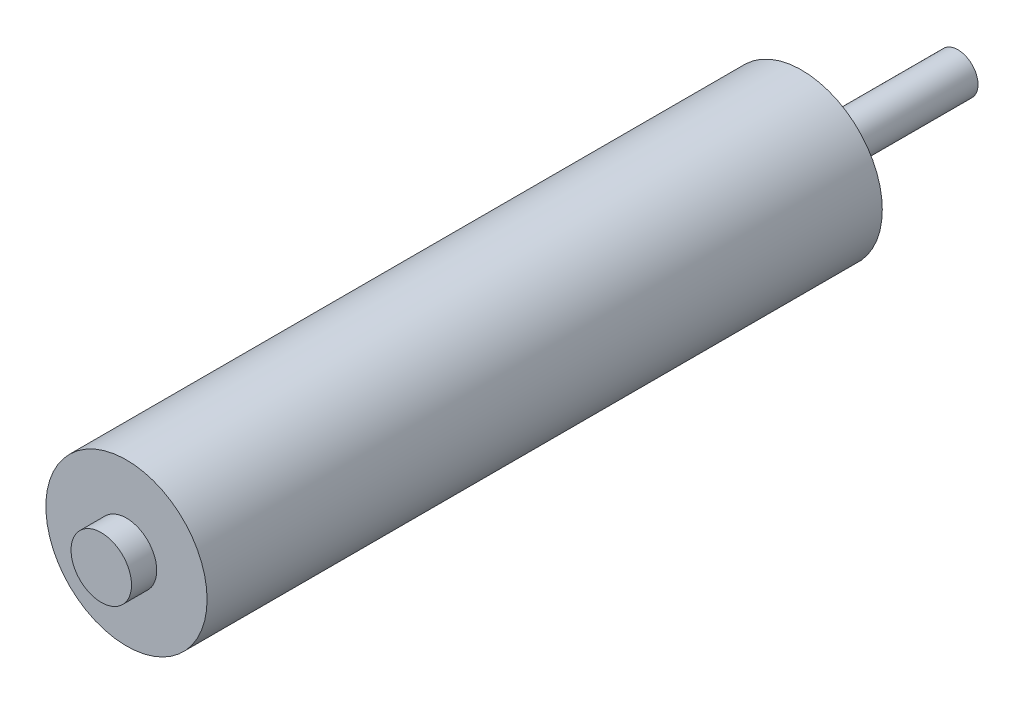
ISO-10303-21;
HEADER;
FILE_DESCRIPTION(('STEP AP214'),'2;1');
FILE_NAME('part.step','',(''),(''),'','','');
FILE_SCHEMA(('AUTOMOTIVE_DESIGN { 1 0 10303 214 1 1 1 1 }'));
ENDSEC;
DATA;
#1=APPLICATION_CONTEXT('core data for automotive mechanical design processes');
#2=APPLICATION_PROTOCOL_DEFINITION('international standard','automotive_design',2000,#1);
#3=PRODUCT_CONTEXT('',#1,'mechanical');
#4=PRODUCT('Part','Part','',(#3));
#5=PRODUCT_RELATED_PRODUCT_CATEGORY('part','',(#4));
#6=PRODUCT_DEFINITION_FORMATION('','',#4);
#7=PRODUCT_DEFINITION_CONTEXT('part definition',#1,'design');
#8=PRODUCT_DEFINITION('design','',#6,#7);
#9=PRODUCT_DEFINITION_SHAPE('','',#8);
#10=(LENGTH_UNIT() NAMED_UNIT(*) SI_UNIT(.MILLI.,.METRE.));
#11=(NAMED_UNIT(*) PLANE_ANGLE_UNIT() SI_UNIT($,.RADIAN.));
#12=(NAMED_UNIT(*) SI_UNIT($,.STERADIAN.) SOLID_ANGLE_UNIT());
#13=UNCERTAINTY_MEASURE_WITH_UNIT(LENGTH_MEASURE(1.E-05),#10,'distance_accuracy_value','');
#14=(GEOMETRIC_REPRESENTATION_CONTEXT(3) GLOBAL_UNCERTAINTY_ASSIGNED_CONTEXT((#13)) GLOBAL_UNIT_ASSIGNED_CONTEXT((#10,
#11,#12)) REPRESENTATION_CONTEXT('',''));
#15=CARTESIAN_POINT('',(0.,0.,0.));
#16=DIRECTION('',(0.,0.,1.));
#17=DIRECTION('',(1.,0.,0.));
#18=AXIS2_PLACEMENT_3D('',#15,#16,#17);
#19=CARTESIAN_POINT('',(0.,0.,-2.5));
#20=DIRECTION('',(0.,0.,-1.));
#21=DIRECTION('',(-1.,0.,0.));
#22=AXIS2_PLACEMENT_3D('',#19,#20,#21);
#23=PLANE('',#22);
#24=CARTESIAN_POINT('',(0.,0.,-2.5));
#25=DIRECTION('',(0.,0.,-1.));
#26=DIRECTION('',(-1.,0.,0.));
#27=AXIS2_PLACEMENT_3D('',#24,#25,#26);
#28=CIRCLE('',#27,3.);
#29=CARTESIAN_POINT('',(-3.,0.,-2.5));
#30=VERTEX_POINT('',#29);
#31=EDGE_CURVE('E68',#30,#30,#28,.T.);
#32=ORIENTED_EDGE('',*,*,#31,.T.);
#33=EDGE_LOOP('',(#32));
#34=FACE_BOUND('',#33,.T.);
#35=CARTESIAN_POINT('',(0.,0.,-2.5));
#36=DIRECTION('',(0.,0.,-1.));
#37=DIRECTION('',(-1.,0.,0.));
#38=AXIS2_PLACEMENT_3D('',#35,#36,#37);
#39=CIRCLE('',#38,2.);
#40=CARTESIAN_POINT('',(-2.,0.,-2.5));
#41=VERTEX_POINT('',#40);
#42=EDGE_CURVE('E74',#41,#41,#39,.T.);
#43=ORIENTED_EDGE('',*,*,#42,.F.);
#44=EDGE_LOOP('',(#43));
#45=FACE_BOUND('',#44,.T.);
#46=ADVANCED_FACE('F47',(#34,#45),#23,.T.);
#47=CARTESIAN_POINT('',(0.,0.,0.));
#48=DIRECTION('',(0.,0.,1.));
#49=DIRECTION('',(1.,0.,0.));
#50=AXIS2_PLACEMENT_3D('',#47,#48,#49);
#51=PLANE('',#50);
#52=CARTESIAN_POINT('',(0.,0.,0.));
#53=DIRECTION('',(0.,0.,1.));
#54=DIRECTION('',(1.,0.,0.));
#55=AXIS2_PLACEMENT_3D('',#52,#53,#54);
#56=CIRCLE('',#55,8.);
#57=CARTESIAN_POINT('',(8.,0.,0.));
#58=VERTEX_POINT('',#57);
#59=EDGE_CURVE('E58',#58,#58,#56,.T.);
#60=ORIENTED_EDGE('',*,*,#59,.F.);
#61=EDGE_LOOP('',(#60));
#62=FACE_BOUND('',#61,.T.);
#63=CARTESIAN_POINT('',(0.,0.,0.));
#64=DIRECTION('',(0.,0.,1.));
#65=DIRECTION('',(1.,0.,0.));
#66=AXIS2_PLACEMENT_3D('',#63,#64,#65);
#67=CIRCLE('',#66,3.);
#68=CARTESIAN_POINT('',(3.,0.,0.));
#69=VERTEX_POINT('',#68);
#70=EDGE_CURVE('E12',#69,#69,#67,.F.);
#71=ORIENTED_EDGE('',*,*,#70,.F.);
#72=EDGE_LOOP('',(#71));
#73=FACE_BOUND('',#72,.T.);
#74=ADVANCED_FACE('F90',(#62,#73),#51,.F.);
#75=CARTESIAN_POINT('',(0.,0.,67.));
#76=DIRECTION('',(0.,0.,1.));
#77=DIRECTION('',(1.,0.,0.));
#78=AXIS2_PLACEMENT_3D('',#75,#76,#77);
#79=PLANE('',#78);
#80=CARTESIAN_POINT('',(0.,0.,67.));
#81=DIRECTION('',(0.,0.,1.));
#82=DIRECTION('',(1.,0.,0.));
#83=AXIS2_PLACEMENT_3D('',#80,#81,#82);
#84=CIRCLE('',#83,8.);
#85=CARTESIAN_POINT('',(8.,0.,67.));
#86=VERTEX_POINT('',#85);
#87=EDGE_CURVE('E54',#86,#86,#84,.T.);
#88=ORIENTED_EDGE('',*,*,#87,.T.);
#89=EDGE_LOOP('',(#88));
#90=FACE_BOUND('',#89,.T.);
#91=CARTESIAN_POINT('',(0.,0.,67.));
#92=DIRECTION('',(0.,0.,1.));
#93=DIRECTION('',(1.,0.,0.));
#94=AXIS2_PLACEMENT_3D('',#91,#92,#93);
#95=CIRCLE('',#94,3.);
#96=CARTESIAN_POINT('',(3.,0.,67.));
#97=VERTEX_POINT('',#96);
#98=EDGE_CURVE('E65',#97,#97,#95,.T.);
#99=ORIENTED_EDGE('',*,*,#98,.F.);
#100=EDGE_LOOP('',(#99));
#101=FACE_BOUND('',#100,.T.);
#102=ADVANCED_FACE('F96',(#90,#101),#79,.T.);
#103=CARTESIAN_POINT('',(0.,0.,67.));
#104=DIRECTION('',(0.,0.,-1.));
#105=DIRECTION('',(-1.,0.,0.));
#106=AXIS2_PLACEMENT_3D('',#103,#104,#105);
#107=CYLINDRICAL_SURFACE('',#106,8.);
#108=ORIENTED_EDGE('',*,*,#87,.F.);
#109=EDGE_LOOP('',(#108));
#110=FACE_BOUND('',#109,.T.);
#111=ORIENTED_EDGE('',*,*,#59,.T.);
#112=EDGE_LOOP('',(#111));
#113=FACE_BOUND('',#112,.T.);
#114=ADVANCED_FACE('F49',(#110,#113),#107,.T.);
#115=CARTESIAN_POINT('',(0.,0.,69.5));
#116=DIRECTION('',(0.,0.,-1.));
#117=DIRECTION('',(-1.,0.,0.));
#118=AXIS2_PLACEMENT_3D('',#115,#116,#117);
#119=CYLINDRICAL_SURFACE('',#118,3.);
#120=CARTESIAN_POINT('',(0.,0.,69.5));
#121=DIRECTION('',(0.,0.,1.));
#122=DIRECTION('',(1.,0.,0.));
#123=AXIS2_PLACEMENT_3D('',#120,#121,#122);
#124=CIRCLE('',#123,3.);
#125=CARTESIAN_POINT('',(3.,0.,69.5));
#126=VERTEX_POINT('',#125);
#127=EDGE_CURVE('E63',#126,#126,#124,.T.);
#128=ORIENTED_EDGE('',*,*,#127,.F.);
#129=EDGE_LOOP('',(#128));
#130=FACE_BOUND('',#129,.T.);
#131=ORIENTED_EDGE('',*,*,#98,.T.);
#132=EDGE_LOOP('',(#131));
#133=FACE_BOUND('',#132,.T.);
#134=ADVANCED_FACE('F106',(#130,#133),#119,.T.);
#135=CARTESIAN_POINT('',(0.,0.,69.5));
#136=DIRECTION('',(0.,0.,1.));
#137=DIRECTION('',(1.,0.,0.));
#138=AXIS2_PLACEMENT_3D('',#135,#136,#137);
#139=PLANE('',#138);
#140=ORIENTED_EDGE('',*,*,#127,.T.);
#141=EDGE_LOOP('',(#140));
#142=FACE_BOUND('',#141,.T.);
#143=ADVANCED_FACE('F102',(#142),#139,.T.);
#144=CARTESIAN_POINT('',(0.,0.,-2.5));
#145=DIRECTION('',(0.,0.,1.));
#146=DIRECTION('',(1.,0.,0.));
#147=AXIS2_PLACEMENT_3D('',#144,#145,#146);
#148=CYLINDRICAL_SURFACE('',#147,3.);
#149=ORIENTED_EDGE('',*,*,#31,.F.);
#150=EDGE_LOOP('',(#149));
#151=FACE_BOUND('',#150,.T.);
#152=ORIENTED_EDGE('',*,*,#70,.T.);
#153=EDGE_LOOP('',(#152));
#154=FACE_BOUND('',#153,.T.);
#155=ADVANCED_FACE('F85',(#151,#154),#148,.T.);
#156=CARTESIAN_POINT('',(0.,0.,-15.5));
#157=DIRECTION('',(0.,0.,1.));
#158=DIRECTION('',(1.,0.,0.));
#159=AXIS2_PLACEMENT_3D('',#156,#157,#158);
#160=CYLINDRICAL_SURFACE('',#159,2.);
#161=CARTESIAN_POINT('',(0.,0.,-15.5));
#162=DIRECTION('',(0.,0.,-1.));
#163=DIRECTION('',(-1.,0.,0.));
#164=AXIS2_PLACEMENT_3D('',#161,#162,#163);
#165=CIRCLE('',#164,2.);
#166=CARTESIAN_POINT('',(-2.,0.,-15.5));
#167=VERTEX_POINT('',#166);
#168=EDGE_CURVE('E73',#167,#167,#165,.T.);
#169=ORIENTED_EDGE('',*,*,#168,.F.);
#170=EDGE_LOOP('',(#169));
#171=FACE_BOUND('',#170,.T.);
#172=ORIENTED_EDGE('',*,*,#42,.T.);
#173=EDGE_LOOP('',(#172));
#174=FACE_BOUND('',#173,.T.);
#175=ADVANCED_FACE('F82',(#171,#174),#160,.T.);
#176=CARTESIAN_POINT('',(0.,0.,-15.5));
#177=DIRECTION('',(0.,0.,-1.));
#178=DIRECTION('',(-1.,0.,0.));
#179=AXIS2_PLACEMENT_3D('',#176,#177,#178);
#180=PLANE('',#179);
#181=ORIENTED_EDGE('',*,*,#168,.T.);
#182=EDGE_LOOP('',(#181));
#183=FACE_BOUND('',#182,.T.);
#184=ADVANCED_FACE('F80',(#183),#180,.T.);
#185=CLOSED_SHELL('',(#46,#74,#102,#114,#134,#143,#155,#175,#184));
#186=MANIFOLD_SOLID_BREP('B2',#185);
#187=ADVANCED_BREP_SHAPE_REPRESENTATION('',(#18,#186),#14);
#188=SHAPE_DEFINITION_REPRESENTATION(#9,#187);
ENDSEC;
END-ISO-10303-21;
